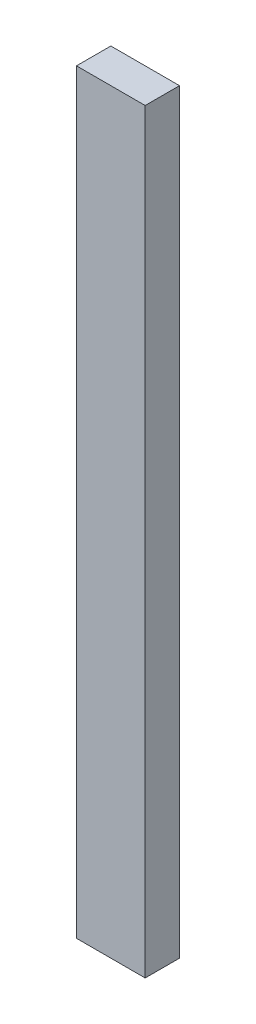
ISO-10303-21;
HEADER;
FILE_DESCRIPTION(('STEP AP214'),'2;1');
FILE_NAME('part.step','',(''),(''),'','','');
FILE_SCHEMA(('AUTOMOTIVE_DESIGN { 1 0 10303 214 1 1 1 1 }'));
ENDSEC;
DATA;
#1=APPLICATION_CONTEXT('core data for automotive mechanical design processes');
#2=APPLICATION_PROTOCOL_DEFINITION('international standard','automotive_design',2000,#1);
#3=PRODUCT_CONTEXT('',#1,'mechanical');
#4=PRODUCT('Part','Part','',(#3));
#5=PRODUCT_RELATED_PRODUCT_CATEGORY('part','',(#4));
#6=PRODUCT_DEFINITION_FORMATION('','',#4);
#7=PRODUCT_DEFINITION_CONTEXT('part definition',#1,'design');
#8=PRODUCT_DEFINITION('design','',#6,#7);
#9=PRODUCT_DEFINITION_SHAPE('','',#8);
#10=(LENGTH_UNIT() NAMED_UNIT(*) SI_UNIT(.MILLI.,.METRE.));
#11=(NAMED_UNIT(*) PLANE_ANGLE_UNIT() SI_UNIT($,.RADIAN.));
#12=(NAMED_UNIT(*) SI_UNIT($,.STERADIAN.) SOLID_ANGLE_UNIT());
#13=UNCERTAINTY_MEASURE_WITH_UNIT(LENGTH_MEASURE(1.E-05),#10,'distance_accuracy_value','');
#14=(GEOMETRIC_REPRESENTATION_CONTEXT(3) GLOBAL_UNCERTAINTY_ASSIGNED_CONTEXT((#13)) GLOBAL_UNIT_ASSIGNED_CONTEXT((#10,
#11,#12)) REPRESENTATION_CONTEXT('',''));
#15=CARTESIAN_POINT('',(0.,0.,0.));
#16=DIRECTION('',(0.,0.,1.));
#17=DIRECTION('',(1.,0.,0.));
#18=AXIS2_PLACEMENT_3D('',#15,#16,#17);
#19=CARTESIAN_POINT('',(0.,0.,10.));
#20=DIRECTION('',(1.,0.,0.));
#21=DIRECTION('',(0.,0.,-1.));
#22=AXIS2_PLACEMENT_3D('',#19,#20,#21);
#23=PLANE('',#22);
#24=DIRECTION('',(0.,-1.,0.));
#25=VECTOR('',#24,1.);
#26=CARTESIAN_POINT('',(0.,0.,0.));
#27=LINE('',#26,#25);
#28=CARTESIAN_POINT('',(0.,220.,0.));
#29=VERTEX_POINT('',#28);
#30=CARTESIAN_POINT('',(0.,0.,0.));
#31=VERTEX_POINT('',#30);
#32=EDGE_CURVE('E107',#29,#31,#27,.T.);
#33=ORIENTED_EDGE('',*,*,#32,.T.);
#34=DIRECTION('',(0.,0.,-1.));
#35=VECTOR('',#34,1.);
#36=CARTESIAN_POINT('',(0.,0.,10.));
#37=LINE('',#36,#35);
#38=CARTESIAN_POINT('',(0.,0.,10.));
#39=VERTEX_POINT('',#38);
#40=EDGE_CURVE('E11',#39,#31,#37,.T.);
#41=ORIENTED_EDGE('',*,*,#40,.F.);
#42=DIRECTION('',(0.,-1.,0.));
#43=VECTOR('',#42,1.);
#44=CARTESIAN_POINT('',(0.,0.,10.));
#45=LINE('',#44,#43);
#46=CARTESIAN_POINT('',(0.,220.,10.));
#47=VERTEX_POINT('',#46);
#48=EDGE_CURVE('E91',#47,#39,#45,.T.);
#49=ORIENTED_EDGE('',*,*,#48,.F.);
#50=DIRECTION('',(0.,0.,-1.));
#51=VECTOR('',#50,1.);
#52=CARTESIAN_POINT('',(0.,220.,10.));
#53=LINE('',#52,#51);
#54=EDGE_CURVE('E103',#47,#29,#53,.T.);
#55=ORIENTED_EDGE('',*,*,#54,.T.);
#56=EDGE_LOOP('',(#33,#41,#49,#55));
#57=FACE_BOUND('',#56,.T.);
#58=ADVANCED_FACE('F39',(#57),#23,.F.);
#59=CARTESIAN_POINT('',(0.,0.,10.));
#60=DIRECTION('',(0.,1.,0.));
#61=DIRECTION('',(0.,0.,1.));
#62=AXIS2_PLACEMENT_3D('',#59,#60,#61);
#63=PLANE('',#62);
#64=DIRECTION('',(1.,0.,0.));
#65=VECTOR('',#64,1.);
#66=CARTESIAN_POINT('',(0.,0.,0.));
#67=LINE('',#66,#65);
#68=CARTESIAN_POINT('',(20.,0.,0.));
#69=VERTEX_POINT('',#68);
#70=EDGE_CURVE('E96',#31,#69,#67,.T.);
#71=ORIENTED_EDGE('',*,*,#70,.T.);
#72=DIRECTION('',(0.,0.,-1.));
#73=VECTOR('',#72,1.);
#74=CARTESIAN_POINT('',(20.,0.,10.));
#75=LINE('',#74,#73);
#76=CARTESIAN_POINT('',(20.,0.,10.));
#77=VERTEX_POINT('',#76);
#78=EDGE_CURVE('E48',#77,#69,#75,.T.);
#79=ORIENTED_EDGE('',*,*,#78,.F.);
#80=DIRECTION('',(1.,0.,0.));
#81=VECTOR('',#80,1.);
#82=CARTESIAN_POINT('',(0.,0.,10.));
#83=LINE('',#82,#81);
#84=EDGE_CURVE('E86',#39,#77,#83,.T.);
#85=ORIENTED_EDGE('',*,*,#84,.F.);
#86=ORIENTED_EDGE('',*,*,#40,.T.);
#87=EDGE_LOOP('',(#71,#79,#85,#86));
#88=FACE_BOUND('',#87,.T.);
#89=ADVANCED_FACE('F95',(#88),#63,.F.);
#90=CARTESIAN_POINT('',(20.,0.,10.));
#91=DIRECTION('',(-1.,0.,0.));
#92=DIRECTION('',(0.,0.,1.));
#93=AXIS2_PLACEMENT_3D('',#90,#91,#92);
#94=PLANE('',#93);
#95=DIRECTION('',(0.,1.,0.));
#96=VECTOR('',#95,1.);
#97=CARTESIAN_POINT('',(20.,0.,0.));
#98=LINE('',#97,#96);
#99=CARTESIAN_POINT('',(20.,220.,0.));
#100=VERTEX_POINT('',#99);
#101=EDGE_CURVE('E73',#69,#100,#98,.T.);
#102=ORIENTED_EDGE('',*,*,#101,.T.);
#103=DIRECTION('',(0.,0.,-1.));
#104=VECTOR('',#103,1.);
#105=CARTESIAN_POINT('',(20.,220.,10.));
#106=LINE('',#105,#104);
#107=CARTESIAN_POINT('',(20.,220.,10.));
#108=VERTEX_POINT('',#107);
#109=EDGE_CURVE('E98',#108,#100,#106,.T.);
#110=ORIENTED_EDGE('',*,*,#109,.F.);
#111=DIRECTION('',(0.,1.,0.));
#112=VECTOR('',#111,1.);
#113=CARTESIAN_POINT('',(20.,0.,10.));
#114=LINE('',#113,#112);
#115=EDGE_CURVE('E89',#77,#108,#114,.T.);
#116=ORIENTED_EDGE('',*,*,#115,.F.);
#117=ORIENTED_EDGE('',*,*,#78,.T.);
#118=EDGE_LOOP('',(#102,#110,#116,#117));
#119=FACE_BOUND('',#118,.T.);
#120=ADVANCED_FACE('F99',(#119),#94,.F.);
#121=CARTESIAN_POINT('',(0.,220.,10.));
#122=DIRECTION('',(0.,-1.,0.));
#123=DIRECTION('',(0.,0.,-1.));
#124=AXIS2_PLACEMENT_3D('',#121,#122,#123);
#125=PLANE('',#124);
#126=DIRECTION('',(-1.,0.,0.));
#127=VECTOR('',#126,1.);
#128=CARTESIAN_POINT('',(0.,220.,0.));
#129=LINE('',#128,#127);
#130=EDGE_CURVE('E79',#100,#29,#129,.T.);
#131=ORIENTED_EDGE('',*,*,#130,.T.);
#132=ORIENTED_EDGE('',*,*,#54,.F.);
#133=DIRECTION('',(-1.,0.,0.));
#134=VECTOR('',#133,1.);
#135=CARTESIAN_POINT('',(0.,220.,10.));
#136=LINE('',#135,#134);
#137=EDGE_CURVE('E56',#108,#47,#136,.T.);
#138=ORIENTED_EDGE('',*,*,#137,.F.);
#139=ORIENTED_EDGE('',*,*,#109,.T.);
#140=EDGE_LOOP('',(#131,#132,#138,#139));
#141=FACE_BOUND('',#140,.T.);
#142=ADVANCED_FACE('F120',(#141),#125,.F.);
#143=CARTESIAN_POINT('',(0.,0.,10.));
#144=DIRECTION('',(0.,0.,-1.));
#145=DIRECTION('',(-1.,0.,0.));
#146=AXIS2_PLACEMENT_3D('',#143,#144,#145);
#147=PLANE('',#146);
#148=ORIENTED_EDGE('',*,*,#48,.T.);
#149=ORIENTED_EDGE('',*,*,#84,.T.);
#150=ORIENTED_EDGE('',*,*,#115,.T.);
#151=ORIENTED_EDGE('',*,*,#137,.T.);
#152=EDGE_LOOP('',(#148,#149,#150,#151));
#153=FACE_BOUND('',#152,.T.);
#154=ADVANCED_FACE('F87',(#153),#147,.F.);
#155=CARTESIAN_POINT('',(0.,0.,0.));
#156=DIRECTION('',(0.,0.,-1.));
#157=DIRECTION('',(-1.,0.,0.));
#158=AXIS2_PLACEMENT_3D('',#155,#156,#157);
#159=PLANE('',#158);
#160=ORIENTED_EDGE('',*,*,#32,.F.);
#161=ORIENTED_EDGE('',*,*,#130,.F.);
#162=ORIENTED_EDGE('',*,*,#101,.F.);
#163=ORIENTED_EDGE('',*,*,#70,.F.);
#164=EDGE_LOOP('',(#160,#161,#162,#163));
#165=FACE_BOUND('',#164,.T.);
#166=ADVANCED_FACE('F123',(#165),#159,.T.);
#167=CLOSED_SHELL('',(#58,#89,#120,#142,#154,#166));
#168=MANIFOLD_SOLID_BREP('B2',#167);
#169=ADVANCED_BREP_SHAPE_REPRESENTATION('',(#18,#168),#14);
#170=SHAPE_DEFINITION_REPRESENTATION(#9,#169);
ENDSEC;
END-ISO-10303-21;
